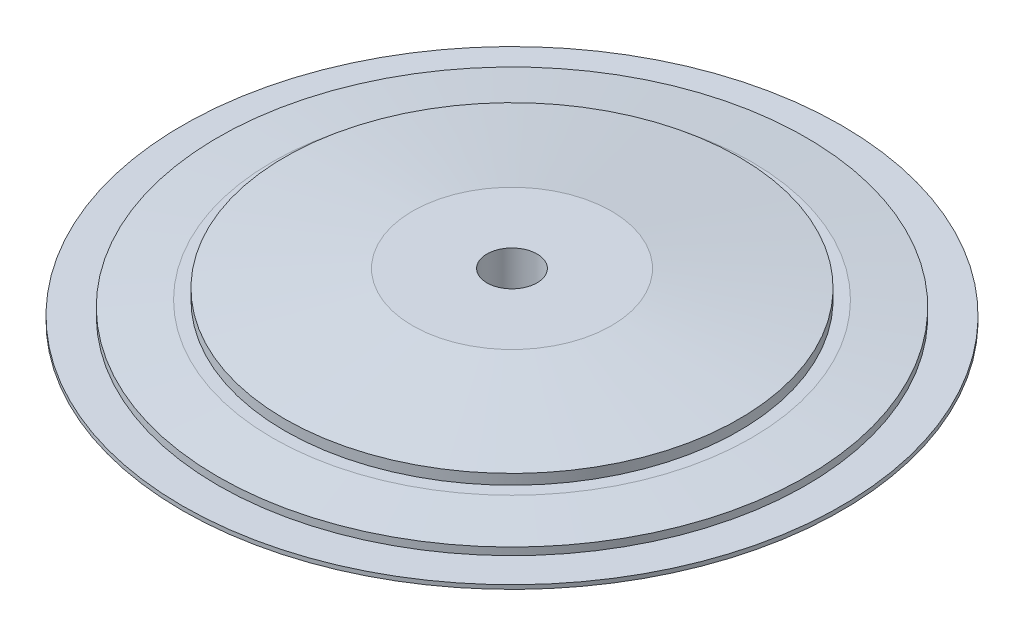
ISO-10303-21;
HEADER;
FILE_DESCRIPTION(('STEP AP214'),'2;1');
FILE_NAME('part.step','',(''),(''),'','','');
FILE_SCHEMA(('AUTOMOTIVE_DESIGN { 1 0 10303 214 1 1 1 1 }'));
ENDSEC;
DATA;
#1=APPLICATION_CONTEXT('core data for automotive mechanical design processes');
#2=APPLICATION_PROTOCOL_DEFINITION('international standard','automotive_design',2000,#1);
#3=PRODUCT_CONTEXT('',#1,'mechanical');
#4=PRODUCT('Part','Part','',(#3));
#5=PRODUCT_RELATED_PRODUCT_CATEGORY('part','',(#4));
#6=PRODUCT_DEFINITION_FORMATION('','',#4);
#7=PRODUCT_DEFINITION_CONTEXT('part definition',#1,'design');
#8=PRODUCT_DEFINITION('design','',#6,#7);
#9=PRODUCT_DEFINITION_SHAPE('','',#8);
#10=(LENGTH_UNIT() NAMED_UNIT(*) SI_UNIT(.MILLI.,.METRE.));
#11=(NAMED_UNIT(*) PLANE_ANGLE_UNIT() SI_UNIT($,.RADIAN.));
#12=(NAMED_UNIT(*) SI_UNIT($,.STERADIAN.) SOLID_ANGLE_UNIT());
#13=UNCERTAINTY_MEASURE_WITH_UNIT(LENGTH_MEASURE(1.E-05),#10,'distance_accuracy_value','');
#14=(GEOMETRIC_REPRESENTATION_CONTEXT(3) GLOBAL_UNCERTAINTY_ASSIGNED_CONTEXT((#13)) GLOBAL_UNIT_ASSIGNED_CONTEXT((#10,
#11,#12)) REPRESENTATION_CONTEXT('',''));
#15=CARTESIAN_POINT('',(0.,0.,0.));
#16=DIRECTION('',(0.,0.,1.));
#17=DIRECTION('',(1.,0.,0.));
#18=AXIS2_PLACEMENT_3D('',#15,#16,#17);
#19=CARTESIAN_POINT('',(0.,11.6760471752082,0.));
#20=DIRECTION('',(0.,1.,0.));
#21=DIRECTION('',(0.,0.,1.));
#22=AXIS2_PLACEMENT_3D('',#19,#20,#21);
#23=CYLINDRICAL_SURFACE('',#22,105.037977294515);
#24=CARTESIAN_POINT('',(0.,1.30040460704473,0.));
#25=DIRECTION('',(0.,1.,0.));
#26=DIRECTION('',(0.,0.,1.));
#27=AXIS2_PLACEMENT_3D('',#24,#25,#26);
#28=CIRCLE('',#27,105.037977294515);
#29=CARTESIAN_POINT('',(0.,1.30040460704473,105.037977294515));
#30=VERTEX_POINT('',#29);
#31=EDGE_CURVE('E10',#30,#30,#28,.T.);
#32=ORIENTED_EDGE('',*,*,#31,.F.);
#33=EDGE_LOOP('',(#32));
#34=FACE_BOUND('',#33,.T.);
#35=CARTESIAN_POINT('',(0.,0.,0.));
#36=DIRECTION('',(0.,1.,0.));
#37=DIRECTION('',(0.,0.,1.));
#38=AXIS2_PLACEMENT_3D('',#35,#36,#37);
#39=CIRCLE('',#38,105.037977294515);
#40=CARTESIAN_POINT('',(0.,0.,105.037977294515));
#41=VERTEX_POINT('',#40);
#42=EDGE_CURVE('E67',#41,#41,#39,.T.);
#43=ORIENTED_EDGE('',*,*,#42,.T.);
#44=EDGE_LOOP('',(#43));
#45=FACE_BOUND('',#44,.T.);
#46=ADVANCED_FACE('F33',(#34,#45),#23,.T.);
#47=CARTESIAN_POINT('',(105.037977294515,1.30040460704472,0.));
#48=DIRECTION('',(0.,-1.,0.));
#49=DIRECTION('',(0.,0.,-1.));
#50=AXIS2_PLACEMENT_3D('',#47,#48,#49);
#51=PLANE('',#50);
#52=CARTESIAN_POINT('',(0.,1.30040460704472,0.));
#53=DIRECTION('',(0.,1.,0.));
#54=DIRECTION('',(0.,0.,1.));
#55=AXIS2_PLACEMENT_3D('',#52,#53,#54);
#56=CIRCLE('',#55,93.700113847018);
#57=CARTESIAN_POINT('',(0.,1.30040460704472,93.700113847018));
#58=VERTEX_POINT('',#57);
#59=EDGE_CURVE('E39',#58,#58,#56,.T.);
#60=ORIENTED_EDGE('',*,*,#59,.F.);
#61=EDGE_LOOP('',(#60));
#62=FACE_BOUND('',#61,.T.);
#63=ORIENTED_EDGE('',*,*,#31,.T.);
#64=EDGE_LOOP('',(#63));
#65=FACE_BOUND('',#64,.T.);
#66=ADVANCED_FACE('F116',(#62,#65),#51,.F.);
#67=CARTESIAN_POINT('',(0.,11.6760471752082,0.));
#68=DIRECTION('',(0.,1.,0.));
#69=DIRECTION('',(0.,0.,1.));
#70=AXIS2_PLACEMENT_3D('',#67,#68,#69);
#71=CYLINDRICAL_SURFACE('',#70,93.700113847018);
#72=CARTESIAN_POINT('',(0.,3.67829034134075,0.));
#73=DIRECTION('',(0.,1.,0.));
#74=DIRECTION('',(0.,0.,1.));
#75=AXIS2_PLACEMENT_3D('',#72,#73,#74);
#76=CIRCLE('',#75,93.700113847018);
#77=CARTESIAN_POINT('',(0.,3.67829034134075,93.700113847018));
#78=VERTEX_POINT('',#77);
#79=EDGE_CURVE('E43',#78,#78,#76,.T.);
#80=ORIENTED_EDGE('',*,*,#79,.F.);
#81=EDGE_LOOP('',(#80));
#82=FACE_BOUND('',#81,.T.);
#83=ORIENTED_EDGE('',*,*,#59,.T.);
#84=EDGE_LOOP('',(#83));
#85=FACE_BOUND('',#84,.T.);
#86=ADVANCED_FACE('F111',(#82,#85),#71,.T.);
#87=CARTESIAN_POINT('',(0.,3.67829034134075,0.));
#88=DIRECTION('',(0.,-1.,0.));
#89=DIRECTION('',(0.,0.,-1.));
#90=AXIS2_PLACEMENT_3D('',#87,#88,#89);
#91=CONICAL_SURFACE('',#90,93.700113847018,1.45783722762275);
#92=CARTESIAN_POINT('',(0.,5.65404361189673,0.));
#93=DIRECTION('',(0.,1.,0.));
#94=DIRECTION('',(0.,0.,1.));
#95=AXIS2_PLACEMENT_3D('',#92,#93,#94);
#96=CIRCLE('',#95,76.2836971969637);
#97=CARTESIAN_POINT('',(0.,5.65404361189673,76.2836971969637));
#98=VERTEX_POINT('',#97);
#99=EDGE_CURVE('E47',#98,#98,#96,.T.);
#100=ORIENTED_EDGE('',*,*,#99,.F.);
#101=EDGE_LOOP('',(#100));
#102=FACE_BOUND('',#101,.T.);
#103=ORIENTED_EDGE('',*,*,#79,.T.);
#104=EDGE_LOOP('',(#103));
#105=FACE_BOUND('',#104,.T.);
#106=ADVANCED_FACE('F105',(#102,#105),#91,.T.);
#107=CARTESIAN_POINT('',(76.2836971969637,5.65404361189673,0.));
#108=DIRECTION('',(0.,-1.,0.));
#109=DIRECTION('',(0.,0.,-1.));
#110=AXIS2_PLACEMENT_3D('',#107,#108,#109);
#111=PLANE('',#110);
#112=CARTESIAN_POINT('',(0.,5.65404361189673,0.));
#113=DIRECTION('',(0.,1.,0.));
#114=DIRECTION('',(0.,0.,1.));
#115=AXIS2_PLACEMENT_3D('',#112,#113,#114);
#116=CIRCLE('',#115,72.3678693223246);
#117=CARTESIAN_POINT('',(0.,5.65404361189673,72.3678693223246));
#118=VERTEX_POINT('',#117);
#119=EDGE_CURVE('E52',#118,#118,#116,.T.);
#120=ORIENTED_EDGE('',*,*,#119,.F.);
#121=EDGE_LOOP('',(#120));
#122=FACE_BOUND('',#121,.T.);
#123=ORIENTED_EDGE('',*,*,#99,.T.);
#124=EDGE_LOOP('',(#123));
#125=FACE_BOUND('',#124,.T.);
#126=ADVANCED_FACE('F99',(#122,#125),#111,.F.);
#127=CARTESIAN_POINT('',(0.,11.6760471752082,0.));
#128=DIRECTION('',(0.,1.,0.));
#129=DIRECTION('',(0.,0.,1.));
#130=AXIS2_PLACEMENT_3D('',#127,#128,#129);
#131=CYLINDRICAL_SURFACE('',#130,72.3678693223246);
#132=CARTESIAN_POINT('',(0.,8.91986549031089,0.));
#133=DIRECTION('',(0.,1.,0.));
#134=DIRECTION('',(0.,0.,1.));
#135=AXIS2_PLACEMENT_3D('',#132,#133,#134);
#136=CIRCLE('',#135,72.3678693223246);
#137=CARTESIAN_POINT('',(0.,8.91986549031089,72.3678693223246));
#138=VERTEX_POINT('',#137);
#139=EDGE_CURVE('E55',#138,#138,#136,.T.);
#140=ORIENTED_EDGE('',*,*,#139,.F.);
#141=EDGE_LOOP('',(#140));
#142=FACE_BOUND('',#141,.T.);
#143=ORIENTED_EDGE('',*,*,#119,.T.);
#144=EDGE_LOOP('',(#143));
#145=FACE_BOUND('',#144,.T.);
#146=ADVANCED_FACE('F93',(#142,#145),#131,.T.);
#147=CARTESIAN_POINT('',(0.,8.91986549031089,0.));
#148=DIRECTION('',(0.,-1.,0.));
#149=DIRECTION('',(0.,0.,-1.));
#150=AXIS2_PLACEMENT_3D('',#147,#148,#149);
#151=CONICAL_SURFACE('',#150,72.3678693223246,1.43843272117076);
#152=CARTESIAN_POINT('',(0.,14.3376433532966,0.));
#153=DIRECTION('',(0.,1.,0.));
#154=DIRECTION('',(0.,0.,1.));
#155=AXIS2_PLACEMENT_3D('',#152,#153,#154);
#156=CIRCLE('',#155,31.6761642788139);
#157=CARTESIAN_POINT('',(0.,14.3376433532966,31.6761642788139));
#158=VERTEX_POINT('',#157);
#159=EDGE_CURVE('E58',#158,#158,#156,.T.);
#160=ORIENTED_EDGE('',*,*,#159,.F.);
#161=EDGE_LOOP('',(#160));
#162=FACE_BOUND('',#161,.T.);
#163=ORIENTED_EDGE('',*,*,#139,.T.);
#164=EDGE_LOOP('',(#163));
#165=FACE_BOUND('',#164,.T.);
#166=ADVANCED_FACE('F87',(#162,#165),#151,.T.);
#167=CARTESIAN_POINT('',(31.6761642788139,14.3376433532966,0.));
#168=DIRECTION('',(0.,-1.,0.));
#169=DIRECTION('',(0.,0.,-1.));
#170=AXIS2_PLACEMENT_3D('',#167,#168,#169);
#171=PLANE('',#170);
#172=CARTESIAN_POINT('',(0.,14.3376433532966,0.));
#173=DIRECTION('',(0.,1.,0.));
#174=DIRECTION('',(0.,0.,1.));
#175=AXIS2_PLACEMENT_3D('',#172,#173,#174);
#176=CIRCLE('',#175,7.98816452021035);
#177=CARTESIAN_POINT('',(0.,14.3376433532966,7.98816452021035));
#178=VERTEX_POINT('',#177);
#179=EDGE_CURVE('E61',#178,#178,#176,.T.);
#180=ORIENTED_EDGE('',*,*,#179,.F.);
#181=EDGE_LOOP('',(#180));
#182=FACE_BOUND('',#181,.T.);
#183=ORIENTED_EDGE('',*,*,#159,.T.);
#184=EDGE_LOOP('',(#183));
#185=FACE_BOUND('',#184,.T.);
#186=ADVANCED_FACE('F81',(#182,#185),#171,.F.);
#187=CARTESIAN_POINT('',(0.,11.6760471752082,0.));
#188=DIRECTION('',(0.,1.,0.));
#189=DIRECTION('',(0.,0.,1.));
#190=AXIS2_PLACEMENT_3D('',#187,#188,#189);
#191=CYLINDRICAL_SURFACE('',#190,7.98816452021035);
#192=CARTESIAN_POINT('',(0.,0.,0.));
#193=DIRECTION('',(0.,1.,0.));
#194=DIRECTION('',(0.,0.,1.));
#195=AXIS2_PLACEMENT_3D('',#192,#193,#194);
#196=CIRCLE('',#195,7.98816452021036);
#197=CARTESIAN_POINT('',(0.,0.,7.98816452021036));
#198=VERTEX_POINT('',#197);
#199=EDGE_CURVE('E64',#198,#198,#196,.T.);
#200=ORIENTED_EDGE('',*,*,#199,.F.);
#201=EDGE_LOOP('',(#200));
#202=FACE_BOUND('',#201,.T.);
#203=ORIENTED_EDGE('',*,*,#179,.T.);
#204=EDGE_LOOP('',(#203));
#205=FACE_BOUND('',#204,.T.);
#206=ADVANCED_FACE('F75',(#202,#205),#191,.F.);
#207=CARTESIAN_POINT('',(7.98816452021036,0.,0.));
#208=DIRECTION('',(0.,1.,0.));
#209=DIRECTION('',(0.,0.,1.));
#210=AXIS2_PLACEMENT_3D('',#207,#208,#209);
#211=PLANE('',#210);
#212=ORIENTED_EDGE('',*,*,#42,.F.);
#213=EDGE_LOOP('',(#212));
#214=FACE_BOUND('',#213,.T.);
#215=ORIENTED_EDGE('',*,*,#199,.T.);
#216=EDGE_LOOP('',(#215));
#217=FACE_BOUND('',#216,.T.);
#218=ADVANCED_FACE('F72',(#214,#217),#211,.F.);
#219=CLOSED_SHELL('',(#46,#66,#86,#106,#126,#146,#166,#186,#206,#218));
#220=MANIFOLD_SOLID_BREP('B2',#219);
#221=ADVANCED_BREP_SHAPE_REPRESENTATION('',(#18,#220),#14);
#222=SHAPE_DEFINITION_REPRESENTATION(#9,#221);
ENDSEC;
END-ISO-10303-21;
